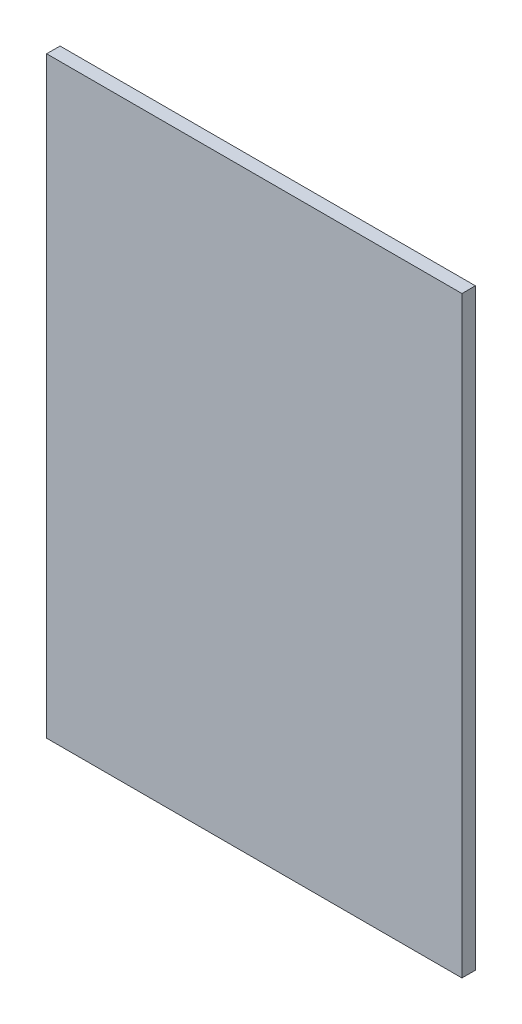
ISO-10303-21;
HEADER;
FILE_DESCRIPTION(('STEP AP214'),'2;1');
FILE_NAME('part.step','',(''),(''),'','','');
FILE_SCHEMA(('AUTOMOTIVE_DESIGN { 1 0 10303 214 1 1 1 1 }'));
ENDSEC;
DATA;
#1=APPLICATION_CONTEXT('core data for automotive mechanical design processes');
#2=APPLICATION_PROTOCOL_DEFINITION('international standard','automotive_design',2000,#1);
#3=PRODUCT_CONTEXT('',#1,'mechanical');
#4=PRODUCT('Part','Part','',(#3));
#5=PRODUCT_RELATED_PRODUCT_CATEGORY('part','',(#4));
#6=PRODUCT_DEFINITION_FORMATION('','',#4);
#7=PRODUCT_DEFINITION_CONTEXT('part definition',#1,'design');
#8=PRODUCT_DEFINITION('design','',#6,#7);
#9=PRODUCT_DEFINITION_SHAPE('','',#8);
#10=(LENGTH_UNIT() NAMED_UNIT(*) SI_UNIT(.MILLI.,.METRE.));
#11=(NAMED_UNIT(*) PLANE_ANGLE_UNIT() SI_UNIT($,.RADIAN.));
#12=(NAMED_UNIT(*) SI_UNIT($,.STERADIAN.) SOLID_ANGLE_UNIT());
#13=UNCERTAINTY_MEASURE_WITH_UNIT(LENGTH_MEASURE(1.E-05),#10,'distance_accuracy_value','');
#14=(GEOMETRIC_REPRESENTATION_CONTEXT(3) GLOBAL_UNCERTAINTY_ASSIGNED_CONTEXT((#13)) GLOBAL_UNIT_ASSIGNED_CONTEXT((#10,
#11,#12)) REPRESENTATION_CONTEXT('',''));
#15=CARTESIAN_POINT('',(0.,0.,0.));
#16=DIRECTION('',(0.,0.,1.));
#17=DIRECTION('',(1.,0.,0.));
#18=AXIS2_PLACEMENT_3D('',#15,#16,#17);
#19=CARTESIAN_POINT('',(96.5770034790039,90.9720001220703,0.));
#20=DIRECTION('',(1.,0.,0.));
#21=DIRECTION('',(0.,-1.,0.));
#22=AXIS2_PLACEMENT_3D('',#19,#20,#21);
#23=PLANE('',#22);
#24=DIRECTION('',(0.,-1.,0.));
#25=VECTOR('',#24,1.);
#26=CARTESIAN_POINT('',(96.5770034790039,90.9720001220703,0.03556));
#27=LINE('',#26,#25);
#28=CARTESIAN_POINT('',(96.5770034790039,90.9720001220703,0.03556));
#29=VERTEX_POINT('',#28);
#30=CARTESIAN_POINT('',(96.5770034790039,89.4020004272461,0.03556));
#31=VERTEX_POINT('',#30);
#32=EDGE_CURVE('E11',#29,#31,#27,.T.);
#33=ORIENTED_EDGE('',*,*,#32,.F.);
#34=DIRECTION('',(0.,0.,1.));
#35=VECTOR('',#34,1.);
#36=CARTESIAN_POINT('',(96.5770034790039,90.9720001220703,0.));
#37=LINE('',#36,#35);
#38=CARTESIAN_POINT('',(96.5770034790039,90.9720001220703,0.));
#39=VERTEX_POINT('',#38);
#40=EDGE_CURVE('E24',#39,#29,#37,.T.);
#41=ORIENTED_EDGE('',*,*,#40,.F.);
#42=DIRECTION('',(0.,-1.,0.));
#43=VECTOR('',#42,1.);
#44=CARTESIAN_POINT('',(96.5770034790039,90.9720001220703,0.));
#45=LINE('',#44,#43);
#46=CARTESIAN_POINT('',(96.5770034790039,89.4020004272461,0.));
#47=VERTEX_POINT('',#46);
#48=EDGE_CURVE('E75',#39,#47,#45,.T.);
#49=ORIENTED_EDGE('',*,*,#48,.T.);
#50=DIRECTION('',(0.,0.,1.));
#51=VECTOR('',#50,1.);
#52=CARTESIAN_POINT('',(96.5770034790039,89.4020004272461,0.));
#53=LINE('',#52,#51);
#54=EDGE_CURVE('E37',#47,#31,#53,.T.);
#55=ORIENTED_EDGE('',*,*,#54,.T.);
#56=EDGE_LOOP('',(#33,#41,#49,#55));
#57=FACE_BOUND('',#56,.T.);
#58=ADVANCED_FACE('F17',(#57),#23,.F.);
#59=CARTESIAN_POINT('',(96.5770034790039,89.4020004272461,0.));
#60=DIRECTION('',(0.,1.,0.));
#61=DIRECTION('',(1.,0.,0.));
#62=AXIS2_PLACEMENT_3D('',#59,#60,#61);
#63=PLANE('',#62);
#64=DIRECTION('',(1.,0.,0.));
#65=VECTOR('',#64,1.);
#66=CARTESIAN_POINT('',(96.5770034790039,89.4020004272461,0.03556));
#67=LINE('',#66,#65);
#68=CARTESIAN_POINT('',(97.677001953125,89.4020004272461,0.03556));
#69=VERTEX_POINT('',#68);
#70=EDGE_CURVE('E83',#31,#69,#67,.T.);
#71=ORIENTED_EDGE('',*,*,#70,.F.);
#72=ORIENTED_EDGE('',*,*,#54,.F.);
#73=DIRECTION('',(1.,0.,0.));
#74=VECTOR('',#73,1.);
#75=CARTESIAN_POINT('',(96.5770034790039,89.4020004272461,0.));
#76=LINE('',#75,#74);
#77=CARTESIAN_POINT('',(97.677001953125,89.4020004272461,0.));
#78=VERTEX_POINT('',#77);
#79=EDGE_CURVE('E81',#47,#78,#76,.T.);
#80=ORIENTED_EDGE('',*,*,#79,.T.);
#81=DIRECTION('',(0.,0.,1.));
#82=VECTOR('',#81,1.);
#83=CARTESIAN_POINT('',(97.677001953125,89.4020004272461,0.));
#84=LINE('',#83,#82);
#85=EDGE_CURVE('E67',#78,#69,#84,.T.);
#86=ORIENTED_EDGE('',*,*,#85,.T.);
#87=EDGE_LOOP('',(#71,#72,#80,#86));
#88=FACE_BOUND('',#87,.T.);
#89=ADVANCED_FACE('F89',(#88),#63,.F.);
#90=CARTESIAN_POINT('',(97.677001953125,89.4020004272461,0.));
#91=DIRECTION('',(-1.,0.,0.));
#92=DIRECTION('',(0.,1.,0.));
#93=AXIS2_PLACEMENT_3D('',#90,#91,#92);
#94=PLANE('',#93);
#95=DIRECTION('',(0.,1.,0.));
#96=VECTOR('',#95,1.);
#97=CARTESIAN_POINT('',(97.677001953125,89.4020004272461,0.03556));
#98=LINE('',#97,#96);
#99=CARTESIAN_POINT('',(97.677001953125,90.9720001220703,0.03556));
#100=VERTEX_POINT('',#99);
#101=EDGE_CURVE('E71',#69,#100,#98,.T.);
#102=ORIENTED_EDGE('',*,*,#101,.F.);
#103=ORIENTED_EDGE('',*,*,#85,.F.);
#104=DIRECTION('',(0.,1.,0.));
#105=VECTOR('',#104,1.);
#106=CARTESIAN_POINT('',(97.677001953125,89.4020004272461,0.));
#107=LINE('',#106,#105);
#108=CARTESIAN_POINT('',(97.677001953125,90.9720001220703,0.));
#109=VERTEX_POINT('',#108);
#110=EDGE_CURVE('E63',#78,#109,#107,.T.);
#111=ORIENTED_EDGE('',*,*,#110,.T.);
#112=DIRECTION('',(0.,0.,1.));
#113=VECTOR('',#112,1.);
#114=CARTESIAN_POINT('',(97.677001953125,90.9720001220703,0.));
#115=LINE('',#114,#113);
#116=EDGE_CURVE('E53',#109,#100,#115,.T.);
#117=ORIENTED_EDGE('',*,*,#116,.T.);
#118=EDGE_LOOP('',(#102,#103,#111,#117));
#119=FACE_BOUND('',#118,.T.);
#120=ADVANCED_FACE('F66',(#119),#94,.F.);
#121=CARTESIAN_POINT('',(97.677001953125,90.9720001220703,0.));
#122=DIRECTION('',(0.,-1.,0.));
#123=DIRECTION('',(-1.,0.,0.));
#124=AXIS2_PLACEMENT_3D('',#121,#122,#123);
#125=PLANE('',#124);
#126=DIRECTION('',(-1.,0.,0.));
#127=VECTOR('',#126,1.);
#128=CARTESIAN_POINT('',(97.677001953125,90.9720001220703,0.03556));
#129=LINE('',#128,#127);
#130=EDGE_CURVE('E59',#100,#29,#129,.T.);
#131=ORIENTED_EDGE('',*,*,#130,.F.);
#132=ORIENTED_EDGE('',*,*,#116,.F.);
#133=DIRECTION('',(-1.,0.,0.));
#134=VECTOR('',#133,1.);
#135=CARTESIAN_POINT('',(97.677001953125,90.9720001220703,0.));
#136=LINE('',#135,#134);
#137=EDGE_CURVE('E57',#109,#39,#136,.T.);
#138=ORIENTED_EDGE('',*,*,#137,.T.);
#139=ORIENTED_EDGE('',*,*,#40,.T.);
#140=EDGE_LOOP('',(#131,#132,#138,#139));
#141=FACE_BOUND('',#140,.T.);
#142=ADVANCED_FACE('F55',(#141),#125,.F.);
#143=CARTESIAN_POINT('',(96.5770034790039,90.9720001220703,0.));
#144=DIRECTION('',(0.,0.,-1.));
#145=DIRECTION('',(-1.,0.,0.));
#146=AXIS2_PLACEMENT_3D('',#143,#144,#145);
#147=PLANE('',#146);
#148=ORIENTED_EDGE('',*,*,#137,.F.);
#149=ORIENTED_EDGE('',*,*,#110,.F.);
#150=ORIENTED_EDGE('',*,*,#79,.F.);
#151=ORIENTED_EDGE('',*,*,#48,.F.);
#152=EDGE_LOOP('',(#148,#149,#150,#151));
#153=FACE_BOUND('',#152,.T.);
#154=ADVANCED_FACE('F74',(#153),#147,.T.);
#155=CARTESIAN_POINT('',(96.5770034790039,90.9720001220703,0.03556));
#156=DIRECTION('',(0.,0.,-1.));
#157=DIRECTION('',(-1.,0.,0.));
#158=AXIS2_PLACEMENT_3D('',#155,#156,#157);
#159=PLANE('',#158);
#160=ORIENTED_EDGE('',*,*,#32,.T.);
#161=ORIENTED_EDGE('',*,*,#70,.T.);
#162=ORIENTED_EDGE('',*,*,#101,.T.);
#163=ORIENTED_EDGE('',*,*,#130,.T.);
#164=EDGE_LOOP('',(#160,#161,#162,#163));
#165=FACE_BOUND('',#164,.T.);
#166=ADVANCED_FACE('F91',(#165),#159,.F.);
#167=CLOSED_SHELL('',(#58,#89,#120,#142,#154,#166));
#168=MANIFOLD_SOLID_BREP('B1',#167);
#169=ADVANCED_BREP_SHAPE_REPRESENTATION('',(#18,#168),#14);
#170=SHAPE_DEFINITION_REPRESENTATION(#9,#169);
ENDSEC;
END-ISO-10303-21;
